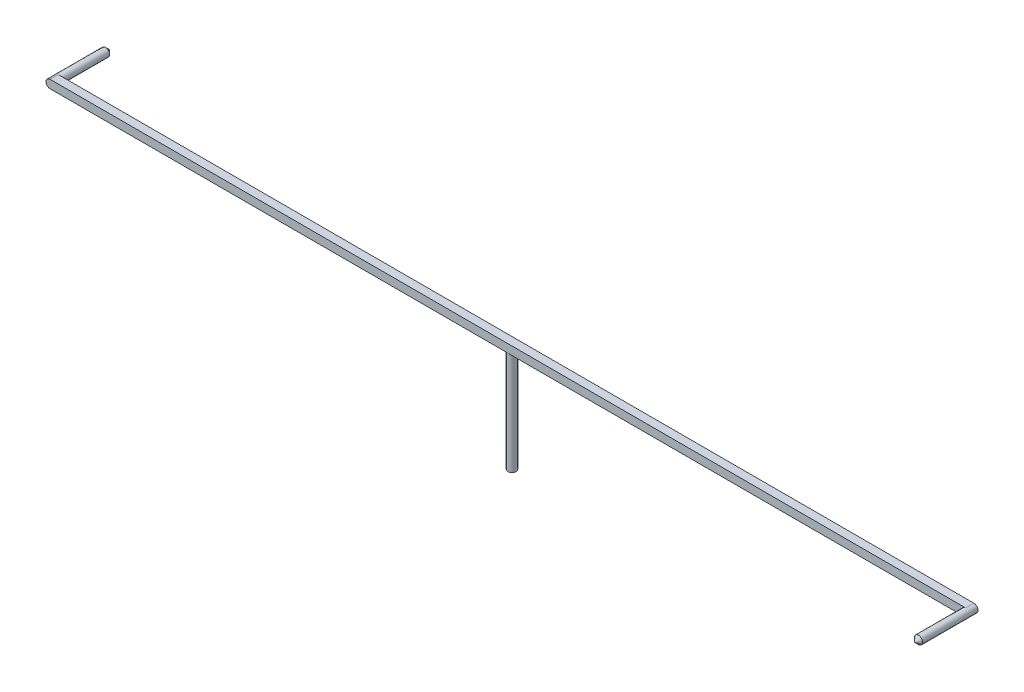
ISO-10303-21;
HEADER;
FILE_DESCRIPTION(('STEP AP214'),'2;1');
FILE_NAME('part.step','',(''),(''),'','','');
FILE_SCHEMA(('AUTOMOTIVE_DESIGN { 1 0 10303 214 1 1 1 1 }'));
ENDSEC;
DATA;
#1=APPLICATION_CONTEXT('core data for automotive mechanical design processes');
#2=APPLICATION_PROTOCOL_DEFINITION('international standard','automotive_design',2000,#1);
#3=PRODUCT_CONTEXT('',#1,'mechanical');
#4=PRODUCT('Part','Part','',(#3));
#5=PRODUCT_RELATED_PRODUCT_CATEGORY('part','',(#4));
#6=PRODUCT_DEFINITION_FORMATION('','',#4);
#7=PRODUCT_DEFINITION_CONTEXT('part definition',#1,'design');
#8=PRODUCT_DEFINITION('design','',#6,#7);
#9=PRODUCT_DEFINITION_SHAPE('','',#8);
#10=(LENGTH_UNIT() NAMED_UNIT(*) SI_UNIT(.MILLI.,.METRE.));
#11=(NAMED_UNIT(*) PLANE_ANGLE_UNIT() SI_UNIT($,.RADIAN.));
#12=(NAMED_UNIT(*) SI_UNIT($,.STERADIAN.) SOLID_ANGLE_UNIT());
#13=UNCERTAINTY_MEASURE_WITH_UNIT(LENGTH_MEASURE(1.E-05),#10,'distance_accuracy_value','');
#14=(GEOMETRIC_REPRESENTATION_CONTEXT(3) GLOBAL_UNCERTAINTY_ASSIGNED_CONTEXT((#13)) GLOBAL_UNIT_ASSIGNED_CONTEXT((#10,
#11,#12)) REPRESENTATION_CONTEXT('',''));
#15=CARTESIAN_POINT('',(0.,0.,0.));
#16=DIRECTION('',(0.,0.,1.));
#17=DIRECTION('',(1.,0.,0.));
#18=AXIS2_PLACEMENT_3D('',#15,#16,#17);
#19=CARTESIAN_POINT('',(0.,10.,0.));
#20=DIRECTION('',(0.,-1.,0.));
#21=DIRECTION('',(0.,0.,-1.));
#22=AXIS2_PLACEMENT_3D('',#19,#20,#21);
#23=CYLINDRICAL_SURFACE('',#22,0.4);
#24=CARTESIAN_POINT('',(0.,10.,0.));
#25=DIRECTION('',(0.,1.,0.));
#26=DIRECTION('',(0.,0.,1.));
#27=AXIS2_PLACEMENT_3D('',#24,#25,#26);
#28=CIRCLE('',#27,0.4);
#29=CARTESIAN_POINT('',(0.,10.,0.4));
#30=VERTEX_POINT('',#29);
#31=CARTESIAN_POINT('',(0.,10.,-0.4));
#32=VERTEX_POINT('',#31);
#33=EDGE_CURVE('E163',#30,#32,#28,.T.);
#34=ORIENTED_EDGE('',*,*,#33,.F.);
#35=EDGE_CURVE('E166',#32,#30,#28,.T.);
#36=ORIENTED_EDGE('',*,*,#35,.F.);
#37=EDGE_LOOP('',(#34,#36));
#38=FACE_BOUND('',#37,.T.);
#39=CARTESIAN_POINT('',(0.,0.,0.));
#40=DIRECTION('',(0.,1.,0.));
#41=DIRECTION('',(0.,0.,1.));
#42=AXIS2_PLACEMENT_3D('',#39,#40,#41);
#43=CIRCLE('',#42,0.4);
#44=CARTESIAN_POINT('',(0.,0.,0.4));
#45=VERTEX_POINT('',#44);
#46=EDGE_CURVE('E152',#45,#45,#43,.T.);
#47=ORIENTED_EDGE('',*,*,#46,.T.);
#48=EDGE_LOOP('',(#47));
#49=FACE_BOUND('',#48,.T.);
#50=ADVANCED_FACE('F34',(#38,#49),#23,.T.);
#51=CARTESIAN_POINT('',(0.,0.,0.));
#52=DIRECTION('',(0.,1.,0.));
#53=DIRECTION('',(0.,0.,1.));
#54=AXIS2_PLACEMENT_3D('',#51,#52,#53);
#55=PLANE('',#54);
#56=ORIENTED_EDGE('',*,*,#46,.F.);
#57=EDGE_LOOP('',(#56));
#58=FACE_BOUND('',#57,.T.);
#59=ADVANCED_FACE('F76',(#58),#55,.F.);
#60=CARTESIAN_POINT('',(0.,10.,0.));
#61=DIRECTION('',(0.,1.,0.));
#62=DIRECTION('',(0.,0.,1.));
#63=AXIS2_PLACEMENT_3D('',#60,#61,#62);
#64=PLANE('',#63);
#65=DIRECTION('',(-1.,0.,0.));
#66=VECTOR('',#65,1.);
#67=CARTESIAN_POINT('',(-45.,10.,-0.4));
#68=LINE('',#67,#66);
#69=CARTESIAN_POINT('',(44.6,10.,-0.4));
#70=VERTEX_POINT('',#69);
#71=EDGE_CURVE('E150',#70,#32,#68,.T.);
#72=ORIENTED_EDGE('',*,*,#71,.F.);
#73=DIRECTION('',(0.,0.,-1.));
#74=VECTOR('',#73,1.);
#75=CARTESIAN_POINT('',(44.6,10.,0.));
#76=LINE('',#75,#74);
#77=CARTESIAN_POINT('',(44.6,10.,0.4));
#78=VERTEX_POINT('',#77);
#79=EDGE_CURVE('E118',#70,#78,#76,.F.);
#80=ORIENTED_EDGE('',*,*,#79,.T.);
#81=DIRECTION('',(1.,0.,0.));
#82=VECTOR('',#81,1.);
#83=CARTESIAN_POINT('',(-45.,10.,0.4));
#84=LINE('',#83,#82);
#85=EDGE_CURVE('E127',#30,#78,#84,.T.);
#86=ORIENTED_EDGE('',*,*,#85,.F.);
#87=ORIENTED_EDGE('',*,*,#33,.T.);
#88=EDGE_LOOP('',(#72,#80,#86,#87));
#89=FACE_BOUND('',#88,.T.);
#90=ADVANCED_FACE('F82',(#89),#64,.F.);
#91=CARTESIAN_POINT('',(-44.6,10.,0.4));
#92=VERTEX_POINT('',#91);
#93=EDGE_CURVE('E160',#92,#30,#84,.T.);
#94=ORIENTED_EDGE('',*,*,#93,.F.);
#95=DIRECTION('',(0.,0.,1.));
#96=VECTOR('',#95,1.);
#97=CARTESIAN_POINT('',(-44.6,10.,0.));
#98=LINE('',#97,#96);
#99=CARTESIAN_POINT('',(-44.6,10.,-0.4));
#100=VERTEX_POINT('',#99);
#101=EDGE_CURVE('E172',#92,#100,#98,.F.);
#102=ORIENTED_EDGE('',*,*,#101,.T.);
#103=EDGE_CURVE('E155',#32,#100,#68,.T.);
#104=ORIENTED_EDGE('',*,*,#103,.F.);
#105=ORIENTED_EDGE('',*,*,#35,.T.);
#106=EDGE_LOOP('',(#94,#102,#104,#105));
#107=FACE_BOUND('',#106,.T.);
#108=ADVANCED_FACE('F178',(#107),#64,.F.);
#109=CARTESIAN_POINT('',(-45.,10.8,0.4));
#110=DIRECTION('',(0.,0.,-1.));
#111=DIRECTION('',(-1.,0.,0.));
#112=AXIS2_PLACEMENT_3D('',#109,#110,#111);
#113=PLANE('',#112);
#114=CARTESIAN_POINT('',(44.6,10.4,0.4));
#115=DIRECTION('',(0.,0.,1.));
#116=DIRECTION('',(1.,0.,0.));
#117=AXIS2_PLACEMENT_3D('',#114,#115,#116);
#118=CIRCLE('',#117,0.399999999999998);
#119=CARTESIAN_POINT('',(44.6,10.8,0.4));
#120=VERTEX_POINT('',#119);
#121=EDGE_CURVE('E107',#120,#78,#118,.T.);
#122=ORIENTED_EDGE('',*,*,#121,.F.);
#123=DIRECTION('',(1.,0.,0.));
#124=VECTOR('',#123,1.);
#125=CARTESIAN_POINT('',(-45.,10.8,0.4));
#126=LINE('',#125,#124);
#127=CARTESIAN_POINT('',(-44.6,10.8,0.4));
#128=VERTEX_POINT('',#127);
#129=EDGE_CURVE('E143',#128,#120,#126,.T.);
#130=ORIENTED_EDGE('',*,*,#129,.F.);
#131=CARTESIAN_POINT('',(-44.6,10.4,0.4));
#132=DIRECTION('',(0.,0.,-1.));
#133=DIRECTION('',(-1.,0.,0.));
#134=AXIS2_PLACEMENT_3D('',#131,#132,#133);
#135=CIRCLE('',#134,0.4);
#136=CARTESIAN_POINT('',(-45.,10.4,0.4));
#137=VERTEX_POINT('',#136);
#138=EDGE_CURVE('E141',#128,#137,#135,.F.);
#139=ORIENTED_EDGE('',*,*,#138,.T.);
#140=CARTESIAN_POINT('',(-44.6,10.4,0.4));
#141=DIRECTION('',(0.,0.,-1.));
#142=DIRECTION('',(-1.,0.,0.));
#143=AXIS2_PLACEMENT_3D('',#140,#141,#142);
#144=CIRCLE('',#143,0.4);
#145=EDGE_CURVE('E170',#137,#92,#144,.F.);
#146=ORIENTED_EDGE('',*,*,#145,.T.);
#147=ORIENTED_EDGE('',*,*,#93,.T.);
#148=ORIENTED_EDGE('',*,*,#85,.T.);
#149=EDGE_LOOP('',(#122,#130,#139,#146,#147,#148));
#150=FACE_BOUND('',#149,.T.);
#151=ADVANCED_FACE('F147',(#150),#113,.F.);
#152=CARTESIAN_POINT('',(-45.,10.8,-0.4));
#153=DIRECTION('',(0.,0.,1.));
#154=DIRECTION('',(1.,0.,0.));
#155=AXIS2_PLACEMENT_3D('',#152,#153,#154);
#156=PLANE('',#155);
#157=CARTESIAN_POINT('',(-44.6,10.4,-0.4));
#158=DIRECTION('',(0.,0.,-1.));
#159=DIRECTION('',(-1.,0.,0.));
#160=AXIS2_PLACEMENT_3D('',#157,#158,#159);
#161=CIRCLE('',#160,0.399999999999998);
#162=CARTESIAN_POINT('',(-44.6,10.8,-0.4));
#163=VERTEX_POINT('',#162);
#164=EDGE_CURVE('E138',#163,#100,#161,.T.);
#165=ORIENTED_EDGE('',*,*,#164,.F.);
#166=DIRECTION('',(-1.,0.,0.));
#167=VECTOR('',#166,1.);
#168=CARTESIAN_POINT('',(-45.,10.8,-0.4));
#169=LINE('',#168,#167);
#170=CARTESIAN_POINT('',(44.6,10.8,-0.4));
#171=VERTEX_POINT('',#170);
#172=EDGE_CURVE('E144',#171,#163,#169,.T.);
#173=ORIENTED_EDGE('',*,*,#172,.F.);
#174=CARTESIAN_POINT('',(44.6,10.4,-0.4));
#175=DIRECTION('',(0.,0.,1.));
#176=DIRECTION('',(1.,0.,0.));
#177=AXIS2_PLACEMENT_3D('',#174,#175,#176);
#178=CIRCLE('',#177,0.4);
#179=CARTESIAN_POINT('',(45.,10.4,-0.4));
#180=VERTEX_POINT('',#179);
#181=EDGE_CURVE('E51',#171,#180,#178,.F.);
#182=ORIENTED_EDGE('',*,*,#181,.T.);
#183=CARTESIAN_POINT('',(44.6,10.4,-0.4));
#184=DIRECTION('',(0.,0.,1.));
#185=DIRECTION('',(1.,0.,0.));
#186=AXIS2_PLACEMENT_3D('',#183,#184,#185);
#187=CIRCLE('',#186,0.4);
#188=EDGE_CURVE('E115',#180,#70,#187,.F.);
#189=ORIENTED_EDGE('',*,*,#188,.T.);
#190=ORIENTED_EDGE('',*,*,#71,.T.);
#191=ORIENTED_EDGE('',*,*,#103,.T.);
#192=EDGE_LOOP('',(#165,#173,#182,#189,#190,#191));
#193=FACE_BOUND('',#192,.T.);
#194=ADVANCED_FACE('F185',(#193),#156,.F.);
#195=CARTESIAN_POINT('',(0.,10.8,0.));
#196=DIRECTION('',(0.,1.,0.));
#197=DIRECTION('',(0.,0.,1.));
#198=AXIS2_PLACEMENT_3D('',#195,#196,#197);
#199=PLANE('',#198);
#200=ORIENTED_EDGE('',*,*,#172,.T.);
#201=DIRECTION('',(0.,0.,1.));
#202=VECTOR('',#201,1.);
#203=CARTESIAN_POINT('',(-44.6,10.8,0.4));
#204=LINE('',#203,#202);
#205=EDGE_CURVE('E114',#163,#128,#204,.T.);
#206=ORIENTED_EDGE('',*,*,#205,.T.);
#207=ORIENTED_EDGE('',*,*,#129,.T.);
#208=DIRECTION('',(0.,0.,-1.));
#209=VECTOR('',#208,1.);
#210=CARTESIAN_POINT('',(44.6,10.8,-0.4));
#211=LINE('',#210,#209);
#212=EDGE_CURVE('E103',#120,#171,#211,.T.);
#213=ORIENTED_EDGE('',*,*,#212,.T.);
#214=EDGE_LOOP('',(#200,#206,#207,#213));
#215=FACE_BOUND('',#214,.T.);
#216=ADVANCED_FACE('F92',(#215),#199,.T.);
#217=CARTESIAN_POINT('',(-44.6,10.4,0.));
#218=DIRECTION('',(0.,0.,-1.));
#219=DIRECTION('',(-1.,0.,0.));
#220=AXIS2_PLACEMENT_3D('',#217,#218,#219);
#221=CYLINDRICAL_SURFACE('',#220,0.4);
#222=CARTESIAN_POINT('',(-44.6,10.4,-4.99999999999999));
#223=DIRECTION('',(0.,0.,-1.));
#224=DIRECTION('',(-1.,0.,0.));
#225=AXIS2_PLACEMENT_3D('',#222,#223,#224);
#226=CIRCLE('',#225,0.4);
#227=CARTESIAN_POINT('',(-45.,10.4,-4.99999999999999));
#228=VERTEX_POINT('',#227);
#229=EDGE_CURVE('E43',#228,#228,#226,.F.);
#230=ORIENTED_EDGE('',*,*,#229,.T.);
#231=EDGE_LOOP('',(#230));
#232=FACE_BOUND('',#231,.T.);
#233=ORIENTED_EDGE('',*,*,#205,.F.);
#234=ORIENTED_EDGE('',*,*,#164,.T.);
#235=ORIENTED_EDGE('',*,*,#101,.F.);
#236=ORIENTED_EDGE('',*,*,#145,.F.);
#237=DIRECTION('',(0.,0.,1.));
#238=VECTOR('',#237,1.);
#239=CARTESIAN_POINT('',(-45.,10.4,-0.4));
#240=LINE('',#239,#238);
#241=CARTESIAN_POINT('',(-45.,10.4,-0.4));
#242=VERTEX_POINT('',#241);
#243=EDGE_CURVE('E125',#137,#242,#240,.F.);
#244=ORIENTED_EDGE('',*,*,#243,.T.);
#245=ORIENTED_EDGE('',*,*,#243,.F.);
#246=ORIENTED_EDGE('',*,*,#138,.F.);
#247=EDGE_LOOP('',(#233,#234,#235,#236,#244,#245,#246));
#248=FACE_BOUND('',#247,.T.);
#249=ADVANCED_FACE('F89',(#232,#248),#221,.T.);
#250=CARTESIAN_POINT('',(44.6,10.4,0.));
#251=DIRECTION('',(0.,0.,1.));
#252=DIRECTION('',(1.,0.,0.));
#253=AXIS2_PLACEMENT_3D('',#250,#251,#252);
#254=CYLINDRICAL_SURFACE('',#253,0.4);
#255=CARTESIAN_POINT('',(44.6,10.4,4.99999999999999));
#256=DIRECTION('',(0.,0.,1.));
#257=DIRECTION('',(1.,0.,0.));
#258=AXIS2_PLACEMENT_3D('',#255,#256,#257);
#259=CIRCLE('',#258,0.4);
#260=CARTESIAN_POINT('',(45.,10.4,4.99999999999999));
#261=VERTEX_POINT('',#260);
#262=EDGE_CURVE('E11',#261,#261,#259,.F.);
#263=ORIENTED_EDGE('',*,*,#262,.T.);
#264=EDGE_LOOP('',(#263));
#265=FACE_BOUND('',#264,.T.);
#266=ORIENTED_EDGE('',*,*,#212,.F.);
#267=ORIENTED_EDGE('',*,*,#121,.T.);
#268=ORIENTED_EDGE('',*,*,#79,.F.);
#269=ORIENTED_EDGE('',*,*,#188,.F.);
#270=DIRECTION('',(0.,0.,-1.));
#271=VECTOR('',#270,1.);
#272=CARTESIAN_POINT('',(45.,10.4,0.4));
#273=LINE('',#272,#271);
#274=CARTESIAN_POINT('',(45.,10.4,0.4));
#275=VERTEX_POINT('',#274);
#276=EDGE_CURVE('E128',#180,#275,#273,.F.);
#277=ORIENTED_EDGE('',*,*,#276,.T.);
#278=ORIENTED_EDGE('',*,*,#276,.F.);
#279=ORIENTED_EDGE('',*,*,#181,.F.);
#280=EDGE_LOOP('',(#266,#267,#268,#269,#277,#278,#279));
#281=FACE_BOUND('',#280,.T.);
#282=ADVANCED_FACE('F72',(#265,#281),#254,.T.);
#283=CARTESIAN_POINT('',(-44.6,10.4,-4.99999999999999));
#284=DIRECTION('',(0.,0.,1.));
#285=DIRECTION('',(1.,0.,0.));
#286=AXIS2_PLACEMENT_3D('',#283,#284,#285);
#287=CONICAL_SURFACE('',#286,0.400000000000011,0.785398163397447);
#288=ORIENTED_EDGE('',*,*,#229,.F.);
#289=EDGE_LOOP('',(#288));
#290=FACE_BOUND('',#289,.T.);
#291=CARTESIAN_POINT('',(-44.6,10.4,-5.4));
#292=VERTEX_POINT('',#291);
#293=VERTEX_LOOP('',#292);
#294=FACE_BOUND('',#293,.T.);
#295=ADVANCED_FACE('F67',(#290,#294),#287,.T.);
#296=CARTESIAN_POINT('',(44.6,10.4,4.99999999999999));
#297=DIRECTION('',(0.,0.,-1.));
#298=DIRECTION('',(-1.,0.,0.));
#299=AXIS2_PLACEMENT_3D('',#296,#297,#298);
#300=CONICAL_SURFACE('',#299,0.400000000000011,0.785398163397447);
#301=ORIENTED_EDGE('',*,*,#262,.F.);
#302=EDGE_LOOP('',(#301));
#303=FACE_BOUND('',#302,.T.);
#304=CARTESIAN_POINT('',(44.6,10.4,5.4));
#305=VERTEX_POINT('',#304);
#306=VERTEX_LOOP('',#305);
#307=FACE_BOUND('',#306,.T.);
#308=ADVANCED_FACE('F36',(#303,#307),#300,.T.);
#309=CLOSED_SHELL('',(#50,#59,#90,#108,#151,#194,#216,#249,#282,#295,#308));
#310=MANIFOLD_SOLID_BREP('B2',#309);
#311=ADVANCED_BREP_SHAPE_REPRESENTATION('',(#18,#310),#14);
#312=SHAPE_DEFINITION_REPRESENTATION(#9,#311);
ENDSEC;
END-ISO-10303-21;
